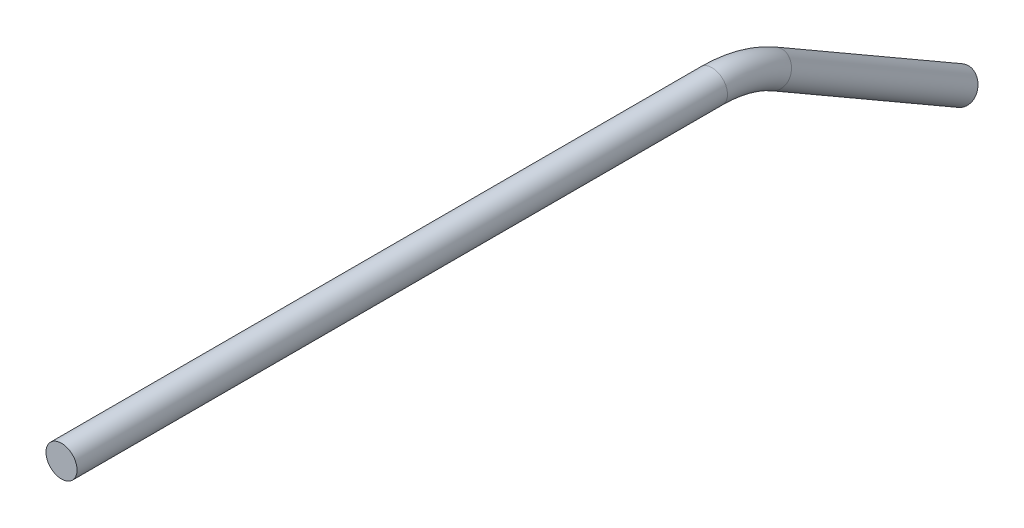
ISO-10303-21;
HEADER;
FILE_DESCRIPTION(('STEP AP214'),'2;1');
FILE_NAME('part.step','',(''),(''),'','','');
FILE_SCHEMA(('AUTOMOTIVE_DESIGN { 1 0 10303 214 1 1 1 1 }'));
ENDSEC;
DATA;
#1=APPLICATION_CONTEXT('core data for automotive mechanical design processes');
#2=APPLICATION_PROTOCOL_DEFINITION('international standard','automotive_design',2000,#1);
#3=PRODUCT_CONTEXT('',#1,'mechanical');
#4=PRODUCT('Part','Part','',(#3));
#5=PRODUCT_RELATED_PRODUCT_CATEGORY('part','',(#4));
#6=PRODUCT_DEFINITION_FORMATION('','',#4);
#7=PRODUCT_DEFINITION_CONTEXT('part definition',#1,'design');
#8=PRODUCT_DEFINITION('design','',#6,#7);
#9=PRODUCT_DEFINITION_SHAPE('','',#8);
#10=(LENGTH_UNIT() NAMED_UNIT(*) SI_UNIT(.MILLI.,.METRE.));
#11=(NAMED_UNIT(*) PLANE_ANGLE_UNIT() SI_UNIT($,.RADIAN.));
#12=(NAMED_UNIT(*) SI_UNIT($,.STERADIAN.) SOLID_ANGLE_UNIT());
#13=UNCERTAINTY_MEASURE_WITH_UNIT(LENGTH_MEASURE(1.E-05),#10,'distance_accuracy_value','');
#14=(GEOMETRIC_REPRESENTATION_CONTEXT(3) GLOBAL_UNCERTAINTY_ASSIGNED_CONTEXT((#13)) GLOBAL_UNIT_ASSIGNED_CONTEXT((#10,
#11,#12)) REPRESENTATION_CONTEXT('',''));
#15=CARTESIAN_POINT('',(0.,0.,0.));
#16=DIRECTION('',(0.,0.,1.));
#17=DIRECTION('',(1.,0.,0.));
#18=AXIS2_PLACEMENT_3D('',#15,#16,#17);
#19=CARTESIAN_POINT('',(0.,-3.40295474387525,-145.594090512249));
#20=DIRECTION('',(0.,-0.500000000000001,-0.866025403784438));
#21=DIRECTION('',(0.,0.866025403784438,-0.500000000000001));
#22=AXIS2_PLACEMENT_3D('',#19,#20,#21);
#23=CYLINDRICAL_SURFACE('',#22,3.175);
#24=CARTESIAN_POINT('',(0.,-3.40295474387525,-145.594090512249));
#25=DIRECTION('',(0.,0.5,0.866025403784439));
#26=DIRECTION('',(1.,0.,0.));
#27=AXIS2_PLACEMENT_3D('',#24,#25,#26);
#28=CIRCLE('',#27,3.175);
#29=CARTESIAN_POINT('',(0.,-0.653324086859659,-147.181590512249));
#30=VERTEX_POINT('',#29);
#31=EDGE_CURVE('E37',#30,#30,#28,.T.);
#32=ORIENTED_EDGE('',*,*,#31,.F.);
#33=EDGE_LOOP('',(#32));
#34=FACE_BOUND('',#33,.T.);
#35=CARTESIAN_POINT('',(0.,-25.4,-183.694090512249));
#36=DIRECTION('',(0.,0.5,0.866025403784439));
#37=DIRECTION('',(1.,0.,0.));
#38=AXIS2_PLACEMENT_3D('',#35,#36,#37);
#39=CIRCLE('',#38,3.175);
#40=CARTESIAN_POINT('',(3.175,-25.4,-183.694090512249));
#41=VERTEX_POINT('',#40);
#42=EDGE_CURVE('E10',#41,#41,#39,.T.);
#43=ORIENTED_EDGE('',*,*,#42,.T.);
#44=EDGE_LOOP('',(#43));
#45=FACE_BOUND('',#44,.T.);
#46=ADVANCED_FACE('F31',(#34,#45),#23,.T.);
#47=CARTESIAN_POINT('',(0.,-25.4,-132.894090512249));
#48=DIRECTION('',(-1.,0.,0.));
#49=DIRECTION('',(0.,0.,1.));
#50=AXIS2_PLACEMENT_3D('',#47,#48,#49);
#51=TOROIDAL_SURFACE('',#50,25.4,3.175);
#52=CARTESIAN_POINT('',(0.,0.,-132.894090512249));
#53=DIRECTION('',(0.,0.,1.));
#54=DIRECTION('',(1.,0.,0.));
#55=AXIS2_PLACEMENT_3D('',#52,#53,#54);
#56=CIRCLE('',#55,3.175);
#57=CARTESIAN_POINT('',(0.,3.175,-132.894090512249));
#58=VERTEX_POINT('',#57);
#59=EDGE_CURVE('E41',#58,#58,#56,.T.);
#60=CARTESIAN_POINT('',(0.,-25.4,-132.894090512249));
#61=DIRECTION('',(-1.,0.,0.));
#62=DIRECTION('',(0.,0.,1.));
#63=AXIS2_PLACEMENT_3D('',#60,#61,#62);
#64=CIRCLE('',#63,28.575);
#65=EDGE_CURVE('',#58,#30,#64,.T.);
#66=ORIENTED_EDGE('',*,*,#59,.F.);
#67=ORIENTED_EDGE('',*,*,#31,.T.);
#68=ORIENTED_EDGE('',*,*,#65,.T.);
#69=ORIENTED_EDGE('',*,*,#65,.F.);
#70=EDGE_LOOP('',(#66,#68,#67,#69));
#71=FACE_BOUND('',#70,.T.);
#72=ADVANCED_FACE('F56',(#71),#51,.T.);
#73=CARTESIAN_POINT('',(0.,0.,-132.894090512249));
#74=DIRECTION('',(0.,0.,1.));
#75=DIRECTION('',(1.,0.,0.));
#76=AXIS2_PLACEMENT_3D('',#73,#74,#75);
#77=CYLINDRICAL_SURFACE('',#76,3.175);
#78=ORIENTED_EDGE('',*,*,#59,.T.);
#79=EDGE_LOOP('',(#78));
#80=FACE_BOUND('',#79,.T.);
#81=CARTESIAN_POINT('',(0.,0.,0.));
#82=DIRECTION('',(0.,0.,1.));
#83=DIRECTION('',(1.,0.,0.));
#84=AXIS2_PLACEMENT_3D('',#81,#82,#83);
#85=CIRCLE('',#84,3.175);
#86=CARTESIAN_POINT('',(3.175,0.,0.));
#87=VERTEX_POINT('',#86);
#88=EDGE_CURVE('E45',#87,#87,#85,.T.);
#89=ORIENTED_EDGE('',*,*,#88,.F.);
#90=EDGE_LOOP('',(#89));
#91=FACE_BOUND('',#90,.T.);
#92=ADVANCED_FACE('F53',(#80,#91),#77,.T.);
#93=CARTESIAN_POINT('',(0.,-25.4,-183.694090512249));
#94=DIRECTION('',(0.,0.5,0.866025403784439));
#95=DIRECTION('',(1.,0.,0.));
#96=AXIS2_PLACEMENT_3D('',#93,#94,#95);
#97=PLANE('',#96);
#98=ORIENTED_EDGE('',*,*,#42,.F.);
#99=EDGE_LOOP('',(#98));
#100=FACE_BOUND('',#99,.T.);
#101=ADVANCED_FACE('F55',(#100),#97,.F.);
#102=CARTESIAN_POINT('',(0.,0.,0.));
#103=DIRECTION('',(0.,0.,1.));
#104=DIRECTION('',(1.,0.,0.));
#105=AXIS2_PLACEMENT_3D('',#102,#103,#104);
#106=PLANE('',#105);
#107=ORIENTED_EDGE('',*,*,#88,.T.);
#108=EDGE_LOOP('',(#107));
#109=FACE_BOUND('',#108,.T.);
#110=ADVANCED_FACE('F51',(#109),#106,.T.);
#111=CLOSED_SHELL('',(#46,#72,#92,#101,#110));
#112=MANIFOLD_SOLID_BREP('B2',#111);
#113=ADVANCED_BREP_SHAPE_REPRESENTATION('',(#18,#112),#14);
#114=SHAPE_DEFINITION_REPRESENTATION(#9,#113);
ENDSEC;
END-ISO-10303-21;
